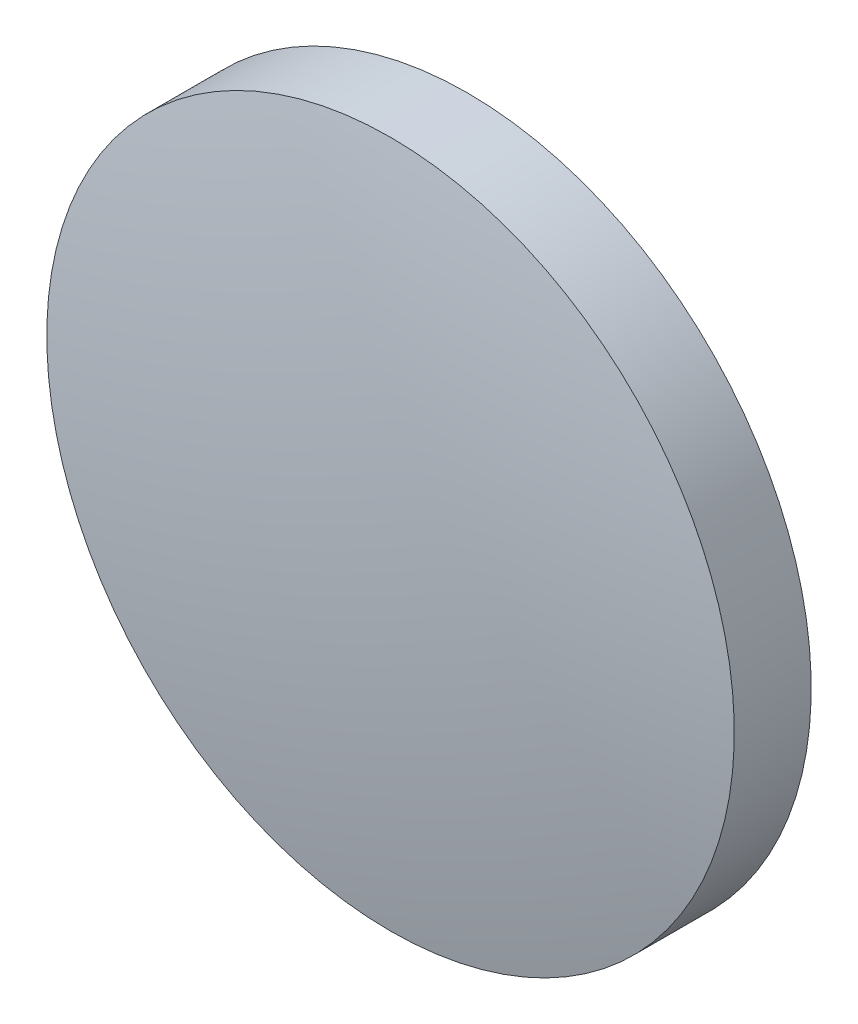
ISO-10303-21;
HEADER;
FILE_DESCRIPTION(('STEP AP214'),'2;1');
FILE_NAME('part.step','',(''),(''),'','','');
FILE_SCHEMA(('AUTOMOTIVE_DESIGN { 1 0 10303 214 1 1 1 1 }'));
ENDSEC;
DATA;
#1=APPLICATION_CONTEXT('core data for automotive mechanical design processes');
#2=APPLICATION_PROTOCOL_DEFINITION('international standard','automotive_design',2000,#1);
#3=PRODUCT_CONTEXT('',#1,'mechanical');
#4=PRODUCT('Part','Part','',(#3));
#5=PRODUCT_RELATED_PRODUCT_CATEGORY('part','',(#4));
#6=PRODUCT_DEFINITION_FORMATION('','',#4);
#7=PRODUCT_DEFINITION_CONTEXT('part definition',#1,'design');
#8=PRODUCT_DEFINITION('design','',#6,#7);
#9=PRODUCT_DEFINITION_SHAPE('','',#8);
#10=(LENGTH_UNIT() NAMED_UNIT(*) SI_UNIT(.MILLI.,.METRE.));
#11=(NAMED_UNIT(*) PLANE_ANGLE_UNIT() SI_UNIT($,.RADIAN.));
#12=(NAMED_UNIT(*) SI_UNIT($,.STERADIAN.) SOLID_ANGLE_UNIT());
#13=UNCERTAINTY_MEASURE_WITH_UNIT(LENGTH_MEASURE(1.E-05),#10,'distance_accuracy_value','');
#14=(GEOMETRIC_REPRESENTATION_CONTEXT(3) GLOBAL_UNCERTAINTY_ASSIGNED_CONTEXT((#13)) GLOBAL_UNIT_ASSIGNED_CONTEXT((#10,
#11,#12)) REPRESENTATION_CONTEXT('',''));
#15=CARTESIAN_POINT('',(0.,0.,0.));
#16=DIRECTION('',(0.,0.,1.));
#17=DIRECTION('',(1.,0.,0.));
#18=AXIS2_PLACEMENT_3D('',#15,#16,#17);
#19=CARTESIAN_POINT('',(0.,0.,-2.));
#20=DIRECTION('',(0.,0.,-1.));
#21=DIRECTION('',(0.,1.,0.));
#22=AXIS2_PLACEMENT_3D('',#19,#20,#21);
#23=PLANE('',#22);
#24=CARTESIAN_POINT('',(0.,0.,-2.));
#25=DIRECTION('',(0.,0.,-1.));
#26=DIRECTION('',(0.,1.,0.));
#27=AXIS2_PLACEMENT_3D('',#24,#25,#26);
#28=CIRCLE('',#27,12.7);
#29=CARTESIAN_POINT('',(0.,12.7,-2.));
#30=VERTEX_POINT('',#29);
#31=EDGE_CURVE('E36',#30,#30,#28,.T.);
#32=ORIENTED_EDGE('',*,*,#31,.T.);
#33=EDGE_LOOP('',(#32));
#34=FACE_BOUND('',#33,.T.);
#35=ADVANCED_FACE('F30',(#34),#23,.T.);
#36=CARTESIAN_POINT('',(0.,0.,-68.2));
#37=DIRECTION('',(0.,0.,-1.));
#38=DIRECTION('',(0.,1.,0.));
#39=AXIS2_PLACEMENT_3D('',#36,#37,#38);
#40=SPHERICAL_SURFACE('',#39,70.1999999999999);
#41=CARTESIAN_POINT('',(0.,0.,0.841654093742382));
#42=DIRECTION('',(0.,0.,-1.));
#43=DIRECTION('',(0.,1.,0.));
#44=AXIS2_PLACEMENT_3D('',#41,#42,#43);
#45=CIRCLE('',#44,12.7);
#46=CARTESIAN_POINT('',(0.,12.7,0.841654093742386));
#47=VERTEX_POINT('',#46);
#48=EDGE_CURVE('E10',#47,#47,#45,.T.);
#49=ORIENTED_EDGE('',*,*,#48,.F.);
#50=EDGE_LOOP('',(#49));
#51=FACE_BOUND('',#50,.T.);
#52=ADVANCED_FACE('F45',(#51),#40,.T.);
#53=CARTESIAN_POINT('',(0.,0.,-2.));
#54=DIRECTION('',(0.,0.,-1.));
#55=DIRECTION('',(0.,1.,0.));
#56=AXIS2_PLACEMENT_3D('',#53,#54,#55);
#57=CYLINDRICAL_SURFACE('',#56,12.7);
#58=ORIENTED_EDGE('',*,*,#48,.T.);
#59=EDGE_LOOP('',(#58));
#60=FACE_BOUND('',#59,.T.);
#61=ORIENTED_EDGE('',*,*,#31,.F.);
#62=EDGE_LOOP('',(#61));
#63=FACE_BOUND('',#62,.T.);
#64=ADVANCED_FACE('F43',(#60,#63),#57,.T.);
#65=CLOSED_SHELL('',(#35,#52,#64));
#66=MANIFOLD_SOLID_BREP('B2',#65);
#67=ADVANCED_BREP_SHAPE_REPRESENTATION('',(#18,#66),#14);
#68=SHAPE_DEFINITION_REPRESENTATION(#9,#67);
ENDSEC;
END-ISO-10303-21;
